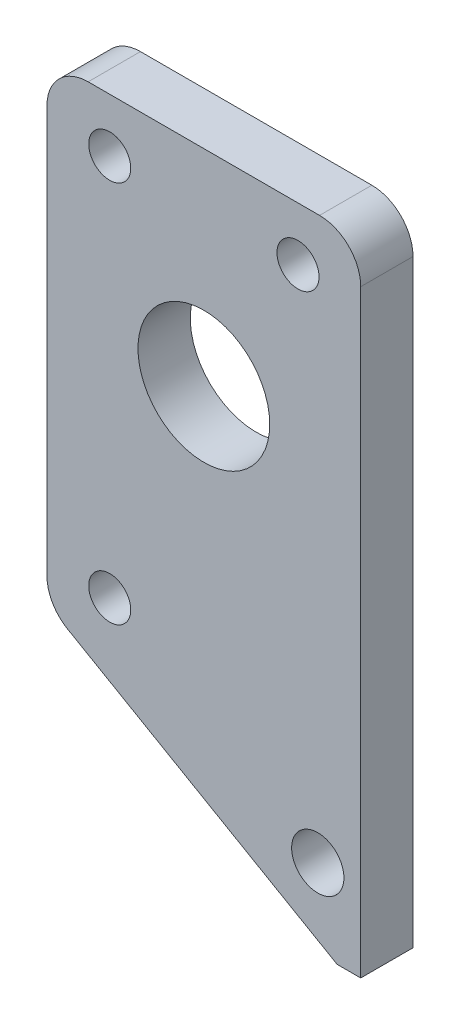
ISO-10303-21;
HEADER;
FILE_DESCRIPTION(('STEP AP214'),'2;1');
FILE_NAME('part.step','',(''),(''),'','','');
FILE_SCHEMA(('AUTOMOTIVE_DESIGN { 1 0 10303 214 1 1 1 1 }'));
ENDSEC;
DATA;
#1=APPLICATION_CONTEXT('core data for automotive mechanical design processes');
#2=APPLICATION_PROTOCOL_DEFINITION('international standard','automotive_design',2000,#1);
#3=PRODUCT_CONTEXT('',#1,'mechanical');
#4=PRODUCT('Part','Part','',(#3));
#5=PRODUCT_RELATED_PRODUCT_CATEGORY('part','',(#4));
#6=PRODUCT_DEFINITION_FORMATION('','',#4);
#7=PRODUCT_DEFINITION_CONTEXT('part definition',#1,'design');
#8=PRODUCT_DEFINITION('design','',#6,#7);
#9=PRODUCT_DEFINITION_SHAPE('','',#8);
#10=(LENGTH_UNIT() NAMED_UNIT(*) SI_UNIT(.MILLI.,.METRE.));
#11=(NAMED_UNIT(*) PLANE_ANGLE_UNIT() SI_UNIT($,.RADIAN.));
#12=(NAMED_UNIT(*) SI_UNIT($,.STERADIAN.) SOLID_ANGLE_UNIT());
#13=UNCERTAINTY_MEASURE_WITH_UNIT(LENGTH_MEASURE(1.E-05),#10,'distance_accuracy_value','');
#14=(GEOMETRIC_REPRESENTATION_CONTEXT(3) GLOBAL_UNCERTAINTY_ASSIGNED_CONTEXT((#13)) GLOBAL_UNIT_ASSIGNED_CONTEXT((#10,
#11,#12)) REPRESENTATION_CONTEXT('',''));
#15=CARTESIAN_POINT('',(0.,0.,0.));
#16=DIRECTION('',(0.,0.,1.));
#17=DIRECTION('',(1.,0.,0.));
#18=AXIS2_PLACEMENT_3D('',#15,#16,#17);
#19=CARTESIAN_POINT('',(0.,0.,6.35));
#20=DIRECTION('',(0.,0.,1.));
#21=DIRECTION('',(1.,0.,0.));
#22=AXIS2_PLACEMENT_3D('',#19,#20,#21);
#23=PLANE('',#22);
#24=CARTESIAN_POINT('',(-11.43,-184.7,6.35));
#25=DIRECTION('',(0.,0.,1.));
#26=DIRECTION('',(1.,0.,0.));
#27=AXIS2_PLACEMENT_3D('',#24,#25,#26);
#28=CIRCLE('',#27,2.55269999999999);
#29=CARTESIAN_POINT('',(-8.87730000000004,-184.7,6.35));
#30=VERTEX_POINT('',#29);
#31=EDGE_CURVE('E175',#30,#30,#28,.T.);
#32=ORIENTED_EDGE('',*,*,#31,.F.);
#33=EDGE_LOOP('',(#32));
#34=FACE_BOUND('',#33,.T.);
#35=CARTESIAN_POINT('',(-11.43,-231.16,6.35));
#36=DIRECTION('',(0.,0.,1.));
#37=DIRECTION('',(1.,0.,0.));
#38=AXIS2_PLACEMENT_3D('',#35,#36,#37);
#39=CIRCLE('',#38,2.55269999999999);
#40=CARTESIAN_POINT('',(-8.87730000000004,-231.16,6.35));
#41=VERTEX_POINT('',#40);
#42=EDGE_CURVE('E164',#41,#41,#39,.T.);
#43=ORIENTED_EDGE('',*,*,#42,.F.);
#44=EDGE_LOOP('',(#43));
#45=FACE_BOUND('',#44,.T.);
#46=CARTESIAN_POINT('',(11.43,-184.7,6.35));
#47=DIRECTION('',(0.,0.,1.));
#48=DIRECTION('',(1.,0.,0.));
#49=AXIS2_PLACEMENT_3D('',#46,#47,#48);
#50=CIRCLE('',#49,2.55269999999999);
#51=CARTESIAN_POINT('',(13.9827,-184.7,6.35));
#52=VERTEX_POINT('',#51);
#53=EDGE_CURVE('E163',#52,#52,#50,.T.);
#54=ORIENTED_EDGE('',*,*,#53,.F.);
#55=EDGE_LOOP('',(#54));
#56=FACE_BOUND('',#55,.T.);
#57=CARTESIAN_POINT('',(13.834070214,-246.4,6.35));
#58=DIRECTION('',(0.,0.,1.));
#59=DIRECTION('',(1.,0.,0.));
#60=AXIS2_PLACEMENT_3D('',#57,#58,#59);
#61=CIRCLE('',#60,3.175);
#62=CARTESIAN_POINT('',(17.009070214,-246.4,6.35));
#63=VERTEX_POINT('',#62);
#64=EDGE_CURVE('E133',#63,#63,#61,.T.);
#65=ORIENTED_EDGE('',*,*,#64,.F.);
#66=EDGE_LOOP('',(#65));
#67=FACE_BOUND('',#66,.T.);
#68=DIRECTION('',(0.,-1.,0.));
#69=VECTOR('',#68,1.);
#70=CARTESIAN_POINT('',(-19.05,-178.2,6.35));
#71=LINE('',#70,#69);
#72=CARTESIAN_POINT('',(-19.05,-183.2,6.35));
#73=VERTEX_POINT('',#72);
#74=CARTESIAN_POINT('',(-19.05,-232.673426119424,6.35));
#75=VERTEX_POINT('',#74);
#76=EDGE_CURVE('E110',#73,#75,#71,.T.);
#77=ORIENTED_EDGE('',*,*,#76,.T.);
#78=CARTESIAN_POINT('',(-14.05,-232.673426119424,6.35));
#79=DIRECTION('',(0.,0.,1.));
#80=DIRECTION('',(1.,0.,0.));
#81=AXIS2_PLACEMENT_3D('',#78,#79,#80);
#82=CIRCLE('',#81,5.);
#83=CARTESIAN_POINT('',(-16.55,-237.003553138346,6.35));
#84=VERTEX_POINT('',#83);
#85=EDGE_CURVE('E106',#75,#84,#82,.T.);
#86=ORIENTED_EDGE('',*,*,#85,.T.);
#87=DIRECTION('',(0.866025403784439,-0.5,0.));
#88=VECTOR('',#87,1.);
#89=CARTESIAN_POINT('',(16.1840702139999,-255.902577388071,6.35));
#90=LINE('',#89,#88);
#91=CARTESIAN_POINT('',(16.1840702139999,-255.902577388071,6.35));
#92=VERTEX_POINT('',#91);
#93=EDGE_CURVE('E98',#84,#92,#90,.T.);
#94=ORIENTED_EDGE('',*,*,#93,.T.);
#95=DIRECTION('',(1.,0.,0.));
#96=VECTOR('',#95,1.);
#97=CARTESIAN_POINT('',(16.1840702139999,-255.902577388071,6.35));
#98=LINE('',#97,#96);
#99=CARTESIAN_POINT('',(19.05,-255.902577388071,6.35));
#100=VERTEX_POINT('',#99);
#101=EDGE_CURVE('E103',#92,#100,#98,.T.);
#102=ORIENTED_EDGE('',*,*,#101,.T.);
#103=DIRECTION('',(0.,1.,0.));
#104=VECTOR('',#103,1.);
#105=CARTESIAN_POINT('',(19.05,-178.2,6.35));
#106=LINE('',#105,#104);
#107=CARTESIAN_POINT('',(19.05,-183.2,6.35));
#108=VERTEX_POINT('',#107);
#109=EDGE_CURVE('E140',#100,#108,#106,.T.);
#110=ORIENTED_EDGE('',*,*,#109,.T.);
#111=CARTESIAN_POINT('',(14.05,-183.2,6.35));
#112=DIRECTION('',(0.,0.,1.));
#113=DIRECTION('',(1.,0.,0.));
#114=AXIS2_PLACEMENT_3D('',#111,#112,#113);
#115=CIRCLE('',#114,5.);
#116=CARTESIAN_POINT('',(14.05,-178.2,6.35));
#117=VERTEX_POINT('',#116);
#118=EDGE_CURVE('E56',#108,#117,#115,.T.);
#119=ORIENTED_EDGE('',*,*,#118,.T.);
#120=DIRECTION('',(-1.,0.,0.));
#121=VECTOR('',#120,1.);
#122=CARTESIAN_POINT('',(-19.05,-178.2,6.35));
#123=LINE('',#122,#121);
#124=CARTESIAN_POINT('',(-14.05,-178.2,6.35));
#125=VERTEX_POINT('',#124);
#126=EDGE_CURVE('E192',#117,#125,#123,.T.);
#127=ORIENTED_EDGE('',*,*,#126,.T.);
#128=CARTESIAN_POINT('',(-14.05,-183.2,6.35));
#129=DIRECTION('',(0.,0.,1.));
#130=DIRECTION('',(1.,0.,0.));
#131=AXIS2_PLACEMENT_3D('',#128,#129,#130);
#132=CIRCLE('',#131,5.);
#133=EDGE_CURVE('E155',#125,#73,#132,.T.);
#134=ORIENTED_EDGE('',*,*,#133,.T.);
#135=EDGE_LOOP('',(#77,#86,#94,#102,#110,#119,#127,#134));
#136=FACE_BOUND('',#135,.T.);
#137=CARTESIAN_POINT('',(0.,-203.2,6.35));
#138=DIRECTION('',(0.,0.,1.));
#139=DIRECTION('',(1.,0.,0.));
#140=AXIS2_PLACEMENT_3D('',#137,#138,#139);
#141=CIRCLE('',#140,8.);
#142=CARTESIAN_POINT('',(7.99999999999992,-203.2,6.35));
#143=VERTEX_POINT('',#142);
#144=EDGE_CURVE('E181',#143,#143,#141,.T.);
#145=ORIENTED_EDGE('',*,*,#144,.F.);
#146=EDGE_LOOP('',(#145));
#147=FACE_BOUND('',#146,.T.);
#148=ADVANCED_FACE('F33',(#34,#45,#56,#67,#136,#147),#23,.T.);
#149=CARTESIAN_POINT('',(0.,0.,0.));
#150=DIRECTION('',(0.,0.,1.));
#151=DIRECTION('',(1.,0.,0.));
#152=AXIS2_PLACEMENT_3D('',#149,#150,#151);
#153=PLANE('',#152);
#154=CARTESIAN_POINT('',(-11.43,-184.7,0.));
#155=DIRECTION('',(0.,0.,1.));
#156=DIRECTION('',(1.,0.,0.));
#157=AXIS2_PLACEMENT_3D('',#154,#155,#156);
#158=CIRCLE('',#157,2.55269999999999);
#159=CARTESIAN_POINT('',(-8.87730000000004,-184.7,0.));
#160=VERTEX_POINT('',#159);
#161=EDGE_CURVE('E37',#160,#160,#158,.T.);
#162=ORIENTED_EDGE('',*,*,#161,.T.);
#163=EDGE_LOOP('',(#162));
#164=FACE_BOUND('',#163,.T.);
#165=CARTESIAN_POINT('',(-11.43,-231.16,0.));
#166=DIRECTION('',(0.,0.,1.));
#167=DIRECTION('',(1.,0.,0.));
#168=AXIS2_PLACEMENT_3D('',#165,#166,#167);
#169=CIRCLE('',#168,2.55269999999999);
#170=CARTESIAN_POINT('',(-8.87730000000004,-231.16,0.));
#171=VERTEX_POINT('',#170);
#172=EDGE_CURVE('E161',#171,#171,#169,.T.);
#173=ORIENTED_EDGE('',*,*,#172,.T.);
#174=EDGE_LOOP('',(#173));
#175=FACE_BOUND('',#174,.T.);
#176=CARTESIAN_POINT('',(11.43,-184.7,0.));
#177=DIRECTION('',(0.,0.,1.));
#178=DIRECTION('',(1.,0.,0.));
#179=AXIS2_PLACEMENT_3D('',#176,#177,#178);
#180=CIRCLE('',#179,2.55269999999999);
#181=CARTESIAN_POINT('',(13.9827,-184.7,0.));
#182=VERTEX_POINT('',#181);
#183=EDGE_CURVE('E168',#182,#182,#180,.T.);
#184=ORIENTED_EDGE('',*,*,#183,.T.);
#185=EDGE_LOOP('',(#184));
#186=FACE_BOUND('',#185,.T.);
#187=DIRECTION('',(0.866025403784439,-0.5,0.));
#188=VECTOR('',#187,1.);
#189=CARTESIAN_POINT('',(16.1840702139999,-255.902577388071,0.));
#190=LINE('',#189,#188);
#191=CARTESIAN_POINT('',(-16.55,-237.003553138346,0.));
#192=VERTEX_POINT('',#191);
#193=CARTESIAN_POINT('',(16.1840702139999,-255.902577388071,0.));
#194=VERTEX_POINT('',#193);
#195=EDGE_CURVE('E116',#192,#194,#190,.T.);
#196=ORIENTED_EDGE('',*,*,#195,.F.);
#197=CARTESIAN_POINT('',(-14.05,-232.673426119424,0.));
#198=DIRECTION('',(0.,0.,1.));
#199=DIRECTION('',(1.,0.,0.));
#200=AXIS2_PLACEMENT_3D('',#197,#198,#199);
#201=CIRCLE('',#200,5.);
#202=CARTESIAN_POINT('',(-19.05,-232.673426119424,0.));
#203=VERTEX_POINT('',#202);
#204=EDGE_CURVE('E147',#192,#203,#201,.F.);
#205=ORIENTED_EDGE('',*,*,#204,.T.);
#206=DIRECTION('',(0.,-1.,0.));
#207=VECTOR('',#206,1.);
#208=CARTESIAN_POINT('',(-19.05,-178.2,0.));
#209=LINE('',#208,#207);
#210=CARTESIAN_POINT('',(-19.05,-183.2,0.));
#211=VERTEX_POINT('',#210);
#212=EDGE_CURVE('E135',#211,#203,#209,.T.);
#213=ORIENTED_EDGE('',*,*,#212,.F.);
#214=CARTESIAN_POINT('',(-14.05,-183.2,0.));
#215=DIRECTION('',(0.,0.,1.));
#216=DIRECTION('',(1.,0.,0.));
#217=AXIS2_PLACEMENT_3D('',#214,#215,#216);
#218=CIRCLE('',#217,5.);
#219=CARTESIAN_POINT('',(-14.05,-178.2,0.));
#220=VERTEX_POINT('',#219);
#221=EDGE_CURVE('E145',#211,#220,#218,.F.);
#222=ORIENTED_EDGE('',*,*,#221,.T.);
#223=DIRECTION('',(-1.,0.,0.));
#224=VECTOR('',#223,1.);
#225=CARTESIAN_POINT('',(-19.05,-178.2,0.));
#226=LINE('',#225,#224);
#227=CARTESIAN_POINT('',(14.05,-178.2,0.));
#228=VERTEX_POINT('',#227);
#229=EDGE_CURVE('E132',#228,#220,#226,.T.);
#230=ORIENTED_EDGE('',*,*,#229,.F.);
#231=CARTESIAN_POINT('',(14.05,-183.2,0.));
#232=DIRECTION('',(0.,0.,1.));
#233=DIRECTION('',(1.,0.,0.));
#234=AXIS2_PLACEMENT_3D('',#231,#232,#233);
#235=CIRCLE('',#234,5.);
#236=CARTESIAN_POINT('',(19.05,-183.2,0.));
#237=VERTEX_POINT('',#236);
#238=EDGE_CURVE('E143',#228,#237,#235,.F.);
#239=ORIENTED_EDGE('',*,*,#238,.T.);
#240=DIRECTION('',(0.,1.,0.));
#241=VECTOR('',#240,1.);
#242=CARTESIAN_POINT('',(19.05,-178.2,0.));
#243=LINE('',#242,#241);
#244=CARTESIAN_POINT('',(19.05,-255.902577388071,0.));
#245=VERTEX_POINT('',#244);
#246=EDGE_CURVE('E129',#245,#237,#243,.T.);
#247=ORIENTED_EDGE('',*,*,#246,.F.);
#248=DIRECTION('',(1.,0.,0.));
#249=VECTOR('',#248,1.);
#250=CARTESIAN_POINT('',(16.1840702139999,-255.902577388071,0.));
#251=LINE('',#250,#249);
#252=EDGE_CURVE('E139',#194,#245,#251,.T.);
#253=ORIENTED_EDGE('',*,*,#252,.F.);
#254=EDGE_LOOP('',(#196,#205,#213,#222,#230,#239,#247,#253));
#255=FACE_BOUND('',#254,.T.);
#256=CARTESIAN_POINT('',(13.834070214,-246.4,0.));
#257=DIRECTION('',(0.,0.,1.));
#258=DIRECTION('',(1.,0.,0.));
#259=AXIS2_PLACEMENT_3D('',#256,#257,#258);
#260=CIRCLE('',#259,3.175);
#261=CARTESIAN_POINT('',(17.009070214,-246.4,0.));
#262=VERTEX_POINT('',#261);
#263=EDGE_CURVE('E184',#262,#262,#260,.T.);
#264=ORIENTED_EDGE('',*,*,#263,.T.);
#265=EDGE_LOOP('',(#264));
#266=FACE_BOUND('',#265,.T.);
#267=CARTESIAN_POINT('',(0.,-203.2,0.));
#268=DIRECTION('',(0.,0.,1.));
#269=DIRECTION('',(1.,0.,0.));
#270=AXIS2_PLACEMENT_3D('',#267,#268,#269);
#271=CIRCLE('',#270,8.);
#272=CARTESIAN_POINT('',(7.99999999999992,-203.2,0.));
#273=VERTEX_POINT('',#272);
#274=EDGE_CURVE('E180',#273,#273,#271,.T.);
#275=ORIENTED_EDGE('',*,*,#274,.T.);
#276=EDGE_LOOP('',(#275));
#277=FACE_BOUND('',#276,.T.);
#278=ADVANCED_FACE('F201',(#164,#175,#186,#255,#266,#277),#153,.F.);
#279=CARTESIAN_POINT('',(19.05,-178.2,6.35));
#280=DIRECTION('',(-1.,0.,0.));
#281=DIRECTION('',(0.,0.,1.));
#282=AXIS2_PLACEMENT_3D('',#279,#280,#281);
#283=PLANE('',#282);
#284=ORIENTED_EDGE('',*,*,#246,.T.);
#285=DIRECTION('',(0.,0.,-1.));
#286=VECTOR('',#285,1.);
#287=CARTESIAN_POINT('',(19.05,-183.2,6.35));
#288=LINE('',#287,#286);
#289=EDGE_CURVE('E11',#237,#108,#288,.F.);
#290=ORIENTED_EDGE('',*,*,#289,.T.);
#291=ORIENTED_EDGE('',*,*,#109,.F.);
#292=DIRECTION('',(0.,0.,-1.));
#293=VECTOR('',#292,1.);
#294=CARTESIAN_POINT('',(19.05,-255.902577388071,6.35));
#295=LINE('',#294,#293);
#296=EDGE_CURVE('E120',#100,#245,#295,.T.);
#297=ORIENTED_EDGE('',*,*,#296,.T.);
#298=EDGE_LOOP('',(#284,#290,#291,#297));
#299=FACE_BOUND('',#298,.T.);
#300=ADVANCED_FACE('F206',(#299),#283,.F.);
#301=CARTESIAN_POINT('',(-19.05,-178.2,6.35));
#302=DIRECTION('',(0.,-1.,0.));
#303=DIRECTION('',(0.,0.,-1.));
#304=AXIS2_PLACEMENT_3D('',#301,#302,#303);
#305=PLANE('',#304);
#306=ORIENTED_EDGE('',*,*,#229,.T.);
#307=DIRECTION('',(0.,0.,-1.));
#308=VECTOR('',#307,1.);
#309=CARTESIAN_POINT('',(-14.05,-178.2,6.35));
#310=LINE('',#309,#308);
#311=EDGE_CURVE('E42',#220,#125,#310,.F.);
#312=ORIENTED_EDGE('',*,*,#311,.T.);
#313=ORIENTED_EDGE('',*,*,#126,.F.);
#314=DIRECTION('',(0.,0.,-1.));
#315=VECTOR('',#314,1.);
#316=CARTESIAN_POINT('',(14.05,-178.2,6.35));
#317=LINE('',#316,#315);
#318=EDGE_CURVE('E158',#117,#228,#317,.T.);
#319=ORIENTED_EDGE('',*,*,#318,.T.);
#320=EDGE_LOOP('',(#306,#312,#313,#319));
#321=FACE_BOUND('',#320,.T.);
#322=ADVANCED_FACE('F211',(#321),#305,.F.);
#323=CARTESIAN_POINT('',(-19.05,-178.2,6.35));
#324=DIRECTION('',(1.,0.,0.));
#325=DIRECTION('',(0.,1.,0.));
#326=AXIS2_PLACEMENT_3D('',#323,#324,#325);
#327=PLANE('',#326);
#328=ORIENTED_EDGE('',*,*,#212,.T.);
#329=DIRECTION('',(0.,0.,-1.));
#330=VECTOR('',#329,1.);
#331=CARTESIAN_POINT('',(-19.05,-232.673426119424,6.35));
#332=LINE('',#331,#330);
#333=EDGE_CURVE('E152',#203,#75,#332,.F.);
#334=ORIENTED_EDGE('',*,*,#333,.T.);
#335=ORIENTED_EDGE('',*,*,#76,.F.);
#336=DIRECTION('',(0.,0.,-1.));
#337=VECTOR('',#336,1.);
#338=CARTESIAN_POINT('',(-19.05,-183.2,6.35));
#339=LINE('',#338,#337);
#340=EDGE_CURVE('E149',#73,#211,#339,.T.);
#341=ORIENTED_EDGE('',*,*,#340,.T.);
#342=EDGE_LOOP('',(#328,#334,#335,#341));
#343=FACE_BOUND('',#342,.T.);
#344=ADVANCED_FACE('F214',(#343),#327,.F.);
#345=CARTESIAN_POINT('',(16.1840702139999,-255.902577388071,6.35));
#346=DIRECTION('',(0.5,0.866025403784439,0.));
#347=DIRECTION('',(-0.866025403784439,0.5,0.));
#348=AXIS2_PLACEMENT_3D('',#345,#346,#347);
#349=PLANE('',#348);
#350=ORIENTED_EDGE('',*,*,#93,.F.);
#351=DIRECTION('',(0.,0.,-1.));
#352=VECTOR('',#351,1.);
#353=CARTESIAN_POINT('',(-16.55,-237.003553138346,6.35));
#354=LINE('',#353,#352);
#355=EDGE_CURVE('E119',#84,#192,#354,.T.);
#356=ORIENTED_EDGE('',*,*,#355,.T.);
#357=ORIENTED_EDGE('',*,*,#195,.T.);
#358=DIRECTION('',(0.,0.,-1.));
#359=VECTOR('',#358,1.);
#360=CARTESIAN_POINT('',(16.1840702139999,-255.902577388071,6.35));
#361=LINE('',#360,#359);
#362=EDGE_CURVE('E113',#92,#194,#361,.T.);
#363=ORIENTED_EDGE('',*,*,#362,.F.);
#364=EDGE_LOOP('',(#350,#356,#357,#363));
#365=FACE_BOUND('',#364,.T.);
#366=ADVANCED_FACE('F114',(#365),#349,.F.);
#367=CARTESIAN_POINT('',(16.1840702139999,-255.902577388071,6.35));
#368=DIRECTION('',(0.,1.,0.));
#369=DIRECTION('',(-1.,0.,0.));
#370=AXIS2_PLACEMENT_3D('',#367,#368,#369);
#371=PLANE('',#370);
#372=ORIENTED_EDGE('',*,*,#252,.T.);
#373=ORIENTED_EDGE('',*,*,#296,.F.);
#374=ORIENTED_EDGE('',*,*,#101,.F.);
#375=ORIENTED_EDGE('',*,*,#362,.T.);
#376=EDGE_LOOP('',(#372,#373,#374,#375));
#377=FACE_BOUND('',#376,.T.);
#378=ADVANCED_FACE('F122',(#377),#371,.F.);
#379=CARTESIAN_POINT('',(13.834070214,-246.4,6.35));
#380=DIRECTION('',(0.,0.,-1.));
#381=DIRECTION('',(-1.,0.,0.));
#382=AXIS2_PLACEMENT_3D('',#379,#380,#381);
#383=CYLINDRICAL_SURFACE('',#382,3.175);
#384=ORIENTED_EDGE('',*,*,#64,.T.);
#385=EDGE_LOOP('',(#384));
#386=FACE_BOUND('',#385,.T.);
#387=ORIENTED_EDGE('',*,*,#263,.F.);
#388=EDGE_LOOP('',(#387));
#389=FACE_BOUND('',#388,.T.);
#390=ADVANCED_FACE('F234',(#386,#389),#383,.F.);
#391=CARTESIAN_POINT('',(0.,-203.2,6.35));
#392=DIRECTION('',(0.,0.,-1.));
#393=DIRECTION('',(-1.,0.,0.));
#394=AXIS2_PLACEMENT_3D('',#391,#392,#393);
#395=CYLINDRICAL_SURFACE('',#394,8.);
#396=ORIENTED_EDGE('',*,*,#144,.T.);
#397=EDGE_LOOP('',(#396));
#398=FACE_BOUND('',#397,.T.);
#399=ORIENTED_EDGE('',*,*,#274,.F.);
#400=EDGE_LOOP('',(#399));
#401=FACE_BOUND('',#400,.T.);
#402=ADVANCED_FACE('F241',(#398,#401),#395,.F.);
#403=CARTESIAN_POINT('',(-14.05,-232.673426119424,6.35));
#404=DIRECTION('',(0.,0.,-1.));
#405=DIRECTION('',(-1.,0.,0.));
#406=AXIS2_PLACEMENT_3D('',#403,#404,#405);
#407=CYLINDRICAL_SURFACE('',#406,5.);
#408=ORIENTED_EDGE('',*,*,#85,.F.);
#409=ORIENTED_EDGE('',*,*,#333,.F.);
#410=ORIENTED_EDGE('',*,*,#204,.F.);
#411=ORIENTED_EDGE('',*,*,#355,.F.);
#412=EDGE_LOOP('',(#408,#409,#410,#411));
#413=FACE_BOUND('',#412,.T.);
#414=ADVANCED_FACE('F199',(#413),#407,.T.);
#415=CARTESIAN_POINT('',(-14.05,-183.2,6.35));
#416=DIRECTION('',(0.,0.,-1.));
#417=DIRECTION('',(-1.,0.,0.));
#418=AXIS2_PLACEMENT_3D('',#415,#416,#417);
#419=CYLINDRICAL_SURFACE('',#418,5.);
#420=ORIENTED_EDGE('',*,*,#133,.F.);
#421=ORIENTED_EDGE('',*,*,#311,.F.);
#422=ORIENTED_EDGE('',*,*,#221,.F.);
#423=ORIENTED_EDGE('',*,*,#340,.F.);
#424=EDGE_LOOP('',(#420,#421,#422,#423));
#425=FACE_BOUND('',#424,.T.);
#426=ADVANCED_FACE('F213',(#425),#419,.T.);
#427=CARTESIAN_POINT('',(14.05,-183.2,6.35));
#428=DIRECTION('',(0.,0.,-1.));
#429=DIRECTION('',(-1.,0.,0.));
#430=AXIS2_PLACEMENT_3D('',#427,#428,#429);
#431=CYLINDRICAL_SURFACE('',#430,5.);
#432=ORIENTED_EDGE('',*,*,#118,.F.);
#433=ORIENTED_EDGE('',*,*,#289,.F.);
#434=ORIENTED_EDGE('',*,*,#238,.F.);
#435=ORIENTED_EDGE('',*,*,#318,.F.);
#436=EDGE_LOOP('',(#432,#433,#434,#435));
#437=FACE_BOUND('',#436,.T.);
#438=ADVANCED_FACE('F35',(#437),#431,.T.);
#439=CARTESIAN_POINT('',(11.43,-184.7,6.35));
#440=DIRECTION('',(0.,0.,1.));
#441=DIRECTION('',(1.,0.,0.));
#442=AXIS2_PLACEMENT_3D('',#439,#440,#441);
#443=CYLINDRICAL_SURFACE('',#442,2.55269999999999);
#444=ORIENTED_EDGE('',*,*,#53,.T.);
#445=EDGE_LOOP('',(#444));
#446=FACE_BOUND('',#445,.T.);
#447=ORIENTED_EDGE('',*,*,#183,.F.);
#448=EDGE_LOOP('',(#447));
#449=FACE_BOUND('',#448,.T.);
#450=ADVANCED_FACE('F259',(#446,#449),#443,.F.);
#451=CARTESIAN_POINT('',(-11.43,-231.16,6.35));
#452=DIRECTION('',(0.,0.,1.));
#453=DIRECTION('',(1.,0.,0.));
#454=AXIS2_PLACEMENT_3D('',#451,#452,#453);
#455=CYLINDRICAL_SURFACE('',#454,2.55269999999999);
#456=ORIENTED_EDGE('',*,*,#42,.T.);
#457=EDGE_LOOP('',(#456));
#458=FACE_BOUND('',#457,.T.);
#459=ORIENTED_EDGE('',*,*,#172,.F.);
#460=EDGE_LOOP('',(#459));
#461=FACE_BOUND('',#460,.T.);
#462=ADVANCED_FACE('F262',(#458,#461),#455,.F.);
#463=CARTESIAN_POINT('',(-11.43,-184.7,6.35));
#464=DIRECTION('',(0.,0.,1.));
#465=DIRECTION('',(1.,0.,0.));
#466=AXIS2_PLACEMENT_3D('',#463,#464,#465);
#467=CYLINDRICAL_SURFACE('',#466,2.55269999999999);
#468=ORIENTED_EDGE('',*,*,#31,.T.);
#469=EDGE_LOOP('',(#468));
#470=FACE_BOUND('',#469,.T.);
#471=ORIENTED_EDGE('',*,*,#161,.F.);
#472=EDGE_LOOP('',(#471));
#473=FACE_BOUND('',#472,.T.);
#474=ADVANCED_FACE('F266',(#470,#473),#467,.F.);
#475=CLOSED_SHELL('',(#148,#278,#300,#322,#344,#366,#378,#390,#402,#414,#426,#438,#450,#462,#474));
#476=MANIFOLD_SOLID_BREP('B2',#475);
#477=ADVANCED_BREP_SHAPE_REPRESENTATION('',(#18,#476),#14);
#478=SHAPE_DEFINITION_REPRESENTATION(#9,#477);
ENDSEC;
END-ISO-10303-21;
